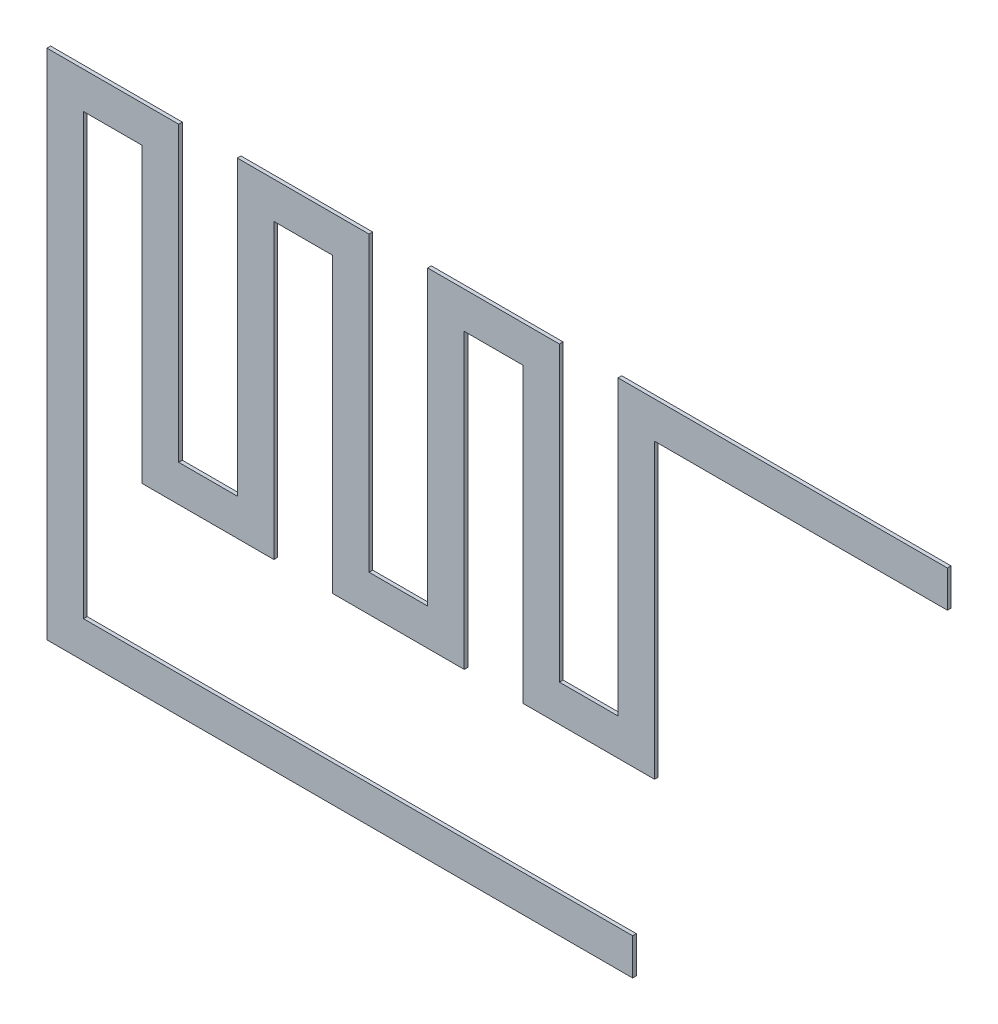
ISO-10303-21;
HEADER;
FILE_DESCRIPTION(('STEP AP214'),'2;1');
FILE_NAME('part.step','',(''),(''),'','','');
FILE_SCHEMA(('AUTOMOTIVE_DESIGN { 1 0 10303 214 1 1 1 1 }'));
ENDSEC;
DATA;
#1=APPLICATION_CONTEXT('core data for automotive mechanical design processes');
#2=APPLICATION_PROTOCOL_DEFINITION('international standard','automotive_design',2000,#1);
#3=PRODUCT_CONTEXT('',#1,'mechanical');
#4=PRODUCT('Part','Part','',(#3));
#5=PRODUCT_RELATED_PRODUCT_CATEGORY('part','',(#4));
#6=PRODUCT_DEFINITION_FORMATION('','',#4);
#7=PRODUCT_DEFINITION_CONTEXT('part definition',#1,'design');
#8=PRODUCT_DEFINITION('design','',#6,#7);
#9=PRODUCT_DEFINITION_SHAPE('','',#8);
#10=(LENGTH_UNIT() NAMED_UNIT(*) SI_UNIT(.MILLI.,.METRE.));
#11=(NAMED_UNIT(*) PLANE_ANGLE_UNIT() SI_UNIT($,.RADIAN.));
#12=(NAMED_UNIT(*) SI_UNIT($,.STERADIAN.) SOLID_ANGLE_UNIT());
#13=UNCERTAINTY_MEASURE_WITH_UNIT(LENGTH_MEASURE(1.E-05),#10,'distance_accuracy_value','');
#14=(GEOMETRIC_REPRESENTATION_CONTEXT(3) GLOBAL_UNCERTAINTY_ASSIGNED_CONTEXT((#13)) GLOBAL_UNIT_ASSIGNED_CONTEXT((#10,
#11,#12)) REPRESENTATION_CONTEXT('',''));
#15=CARTESIAN_POINT('',(0.,0.,0.));
#16=DIRECTION('',(0.,0.,1.));
#17=DIRECTION('',(1.,0.,0.));
#18=AXIS2_PLACEMENT_3D('',#15,#16,#17);
#19=CARTESIAN_POINT('',(4.513681102362,4.058562992126,0.025));
#20=DIRECTION('',(0.,0.,1.));
#21=DIRECTION('',(1.,0.,0.));
#22=AXIS2_PLACEMENT_3D('',#19,#20,#21);
#23=PLANE('',#22);
#24=DIRECTION('',(1.,0.,0.));
#25=VECTOR('',#24,1.);
#26=CARTESIAN_POINT('',(2.6,3.,0.025));
#27=LINE('',#26,#25);
#28=CARTESIAN_POINT('',(1.8,3.,0.025));
#29=VERTEX_POINT('',#28);
#30=CARTESIAN_POINT('',(2.6,3.,0.025));
#31=VERTEX_POINT('',#30);
#32=EDGE_CURVE('E463',#29,#31,#27,.T.);
#33=ORIENTED_EDGE('',*,*,#32,.F.);
#34=DIRECTION('',(0.,-1.,0.));
#35=VECTOR('',#34,1.);
#36=CARTESIAN_POINT('',(1.8,3.,0.025));
#37=LINE('',#36,#35);
#38=CARTESIAN_POINT('',(1.8,7.,0.025));
#39=VERTEX_POINT('',#38);
#40=EDGE_CURVE('E411',#39,#29,#37,.T.);
#41=ORIENTED_EDGE('',*,*,#40,.F.);
#42=DIRECTION('',(1.,0.,0.));
#43=VECTOR('',#42,1.);
#44=CARTESIAN_POINT('',(1.8,7.,0.025));
#45=LINE('',#44,#43);
#46=CARTESIAN_POINT('',(0.,7.,0.025));
#47=VERTEX_POINT('',#46);
#48=EDGE_CURVE('E358',#47,#39,#45,.T.);
#49=ORIENTED_EDGE('',*,*,#48,.F.);
#50=DIRECTION('',(0.,1.,0.));
#51=VECTOR('',#50,1.);
#52=CARTESIAN_POINT('',(0.,7.,0.025));
#53=LINE('',#52,#51);
#54=CARTESIAN_POINT('',(0.,0.,0.025));
#55=VERTEX_POINT('',#54);
#56=EDGE_CURVE('E357',#55,#47,#53,.T.);
#57=ORIENTED_EDGE('',*,*,#56,.F.);
#58=DIRECTION('',(-1.,0.,0.));
#59=VECTOR('',#58,1.);
#60=CARTESIAN_POINT('',(0.,0.,0.025));
#61=LINE('',#60,#59);
#62=CARTESIAN_POINT('',(8.,0.,0.025));
#63=VERTEX_POINT('',#62);
#64=EDGE_CURVE('E487',#63,#55,#61,.T.);
#65=ORIENTED_EDGE('',*,*,#64,.F.);
#66=DIRECTION('',(0.,-1.,0.));
#67=VECTOR('',#66,1.);
#68=CARTESIAN_POINT('',(8.,0.,0.025));
#69=LINE('',#68,#67);
#70=CARTESIAN_POINT('',(8.,0.5,0.025));
#71=VERTEX_POINT('',#70);
#72=EDGE_CURVE('E27',#71,#63,#69,.T.);
#73=ORIENTED_EDGE('',*,*,#72,.F.);
#74=DIRECTION('',(1.,0.,0.));
#75=VECTOR('',#74,1.);
#76=CARTESIAN_POINT('',(8.,0.5,0.025));
#77=LINE('',#76,#75);
#78=CARTESIAN_POINT('',(0.5,0.5,0.025));
#79=VERTEX_POINT('',#78);
#80=EDGE_CURVE('E11',#79,#71,#77,.T.);
#81=ORIENTED_EDGE('',*,*,#80,.F.);
#82=DIRECTION('',(0.,-1.,0.));
#83=VECTOR('',#82,1.);
#84=CARTESIAN_POINT('',(0.5,0.5,0.025));
#85=LINE('',#84,#83);
#86=CARTESIAN_POINT('',(0.5,6.5,0.025));
#87=VERTEX_POINT('',#86);
#88=EDGE_CURVE('E380',#87,#79,#85,.T.);
#89=ORIENTED_EDGE('',*,*,#88,.F.);
#90=DIRECTION('',(-1.,0.,0.));
#91=VECTOR('',#90,1.);
#92=CARTESIAN_POINT('',(0.5,6.5,0.025));
#93=LINE('',#92,#91);
#94=CARTESIAN_POINT('',(1.3,6.5,0.025));
#95=VERTEX_POINT('',#94);
#96=EDGE_CURVE('E275',#95,#87,#93,.T.);
#97=ORIENTED_EDGE('',*,*,#96,.F.);
#98=DIRECTION('',(0.,1.,0.));
#99=VECTOR('',#98,1.);
#100=CARTESIAN_POINT('',(1.3,6.5,0.025));
#101=LINE('',#100,#99);
#102=CARTESIAN_POINT('',(1.3,2.5,0.025));
#103=VERTEX_POINT('',#102);
#104=EDGE_CURVE('E274',#103,#95,#101,.T.);
#105=ORIENTED_EDGE('',*,*,#104,.F.);
#106=DIRECTION('',(-1.,0.,0.));
#107=VECTOR('',#106,1.);
#108=CARTESIAN_POINT('',(1.3,2.5,0.025));
#109=LINE('',#108,#107);
#110=CARTESIAN_POINT('',(3.1,2.5,0.025));
#111=VERTEX_POINT('',#110);
#112=EDGE_CURVE('E270',#111,#103,#109,.T.);
#113=ORIENTED_EDGE('',*,*,#112,.F.);
#114=DIRECTION('',(0.,-1.,0.));
#115=VECTOR('',#114,1.);
#116=CARTESIAN_POINT('',(3.1,2.5,0.025));
#117=LINE('',#116,#115);
#118=CARTESIAN_POINT('',(3.1,6.5,0.025));
#119=VERTEX_POINT('',#118);
#120=EDGE_CURVE('E432',#119,#111,#117,.T.);
#121=ORIENTED_EDGE('',*,*,#120,.F.);
#122=DIRECTION('',(-1.,0.,0.));
#123=VECTOR('',#122,1.);
#124=CARTESIAN_POINT('',(3.1,6.5,0.025));
#125=LINE('',#124,#123);
#126=CARTESIAN_POINT('',(3.9,6.5,0.025));
#127=VERTEX_POINT('',#126);
#128=EDGE_CURVE('E20',#127,#119,#125,.T.);
#129=ORIENTED_EDGE('',*,*,#128,.F.);
#130=DIRECTION('',(0.,1.,0.));
#131=VECTOR('',#130,1.);
#132=CARTESIAN_POINT('',(3.9,6.5,0.025));
#133=LINE('',#132,#131);
#134=CARTESIAN_POINT('',(3.9,2.5,0.025));
#135=VERTEX_POINT('',#134);
#136=EDGE_CURVE('E376',#135,#127,#133,.T.);
#137=ORIENTED_EDGE('',*,*,#136,.F.);
#138=DIRECTION('',(-1.,0.,0.));
#139=VECTOR('',#138,1.);
#140=CARTESIAN_POINT('',(3.9,2.5,0.025));
#141=LINE('',#140,#139);
#142=CARTESIAN_POINT('',(5.7,2.5,0.025));
#143=VERTEX_POINT('',#142);
#144=EDGE_CURVE('E495',#143,#135,#141,.T.);
#145=ORIENTED_EDGE('',*,*,#144,.F.);
#146=DIRECTION('',(0.,-1.,0.));
#147=VECTOR('',#146,1.);
#148=CARTESIAN_POINT('',(5.7,2.5,0.025));
#149=LINE('',#148,#147);
#150=CARTESIAN_POINT('',(5.7,6.5,0.025));
#151=VERTEX_POINT('',#150);
#152=EDGE_CURVE('E359',#151,#143,#149,.T.);
#153=ORIENTED_EDGE('',*,*,#152,.F.);
#154=DIRECTION('',(-1.,0.,0.));
#155=VECTOR('',#154,1.);
#156=CARTESIAN_POINT('',(5.7,6.5,0.025));
#157=LINE('',#156,#155);
#158=CARTESIAN_POINT('',(6.5,6.5,0.025));
#159=VERTEX_POINT('',#158);
#160=EDGE_CURVE('E458',#159,#151,#157,.T.);
#161=ORIENTED_EDGE('',*,*,#160,.F.);
#162=DIRECTION('',(0.,1.,0.));
#163=VECTOR('',#162,1.);
#164=CARTESIAN_POINT('',(6.5,6.5,0.025));
#165=LINE('',#164,#163);
#166=CARTESIAN_POINT('',(6.5,2.5,0.025));
#167=VERTEX_POINT('',#166);
#168=EDGE_CURVE('E312',#167,#159,#165,.T.);
#169=ORIENTED_EDGE('',*,*,#168,.F.);
#170=DIRECTION('',(-1.,0.,0.));
#171=VECTOR('',#170,1.);
#172=CARTESIAN_POINT('',(6.5,2.5,0.025));
#173=LINE('',#172,#171);
#174=CARTESIAN_POINT('',(8.3,2.5,0.025));
#175=VERTEX_POINT('',#174);
#176=EDGE_CURVE('E335',#175,#167,#173,.T.);
#177=ORIENTED_EDGE('',*,*,#176,.F.);
#178=DIRECTION('',(0.,-1.,0.));
#179=VECTOR('',#178,1.);
#180=CARTESIAN_POINT('',(8.3,2.5,0.025));
#181=LINE('',#180,#179);
#182=CARTESIAN_POINT('',(8.3,6.5,0.025));
#183=VERTEX_POINT('',#182);
#184=EDGE_CURVE('E334',#183,#175,#181,.T.);
#185=ORIENTED_EDGE('',*,*,#184,.F.);
#186=DIRECTION('',(-1.,0.,0.));
#187=VECTOR('',#186,1.);
#188=CARTESIAN_POINT('',(8.3,6.5,0.025));
#189=LINE('',#188,#187);
#190=CARTESIAN_POINT('',(12.3,6.5,0.025));
#191=VERTEX_POINT('',#190);
#192=EDGE_CURVE('E398',#191,#183,#189,.T.);
#193=ORIENTED_EDGE('',*,*,#192,.F.);
#194=DIRECTION('',(0.,-1.,0.));
#195=VECTOR('',#194,1.);
#196=CARTESIAN_POINT('',(12.3,6.5,0.025));
#197=LINE('',#196,#195);
#198=CARTESIAN_POINT('',(12.3,7.,0.025));
#199=VERTEX_POINT('',#198);
#200=EDGE_CURVE('E436',#199,#191,#197,.T.);
#201=ORIENTED_EDGE('',*,*,#200,.F.);
#202=DIRECTION('',(1.,0.,0.));
#203=VECTOR('',#202,1.);
#204=CARTESIAN_POINT('',(12.3,7.,0.025));
#205=LINE('',#204,#203);
#206=CARTESIAN_POINT('',(7.8,7.,0.025));
#207=VERTEX_POINT('',#206);
#208=EDGE_CURVE('E329',#207,#199,#205,.T.);
#209=ORIENTED_EDGE('',*,*,#208,.F.);
#210=DIRECTION('',(0.,1.,0.));
#211=VECTOR('',#210,1.);
#212=CARTESIAN_POINT('',(7.8,7.,0.025));
#213=LINE('',#212,#211);
#214=CARTESIAN_POINT('',(7.8,3.,0.025));
#215=VERTEX_POINT('',#214);
#216=EDGE_CURVE('E328',#215,#207,#213,.T.);
#217=ORIENTED_EDGE('',*,*,#216,.F.);
#218=DIRECTION('',(1.,0.,0.));
#219=VECTOR('',#218,1.);
#220=CARTESIAN_POINT('',(7.8,3.,0.025));
#221=LINE('',#220,#219);
#222=CARTESIAN_POINT('',(7.,3.,0.025));
#223=VERTEX_POINT('',#222);
#224=EDGE_CURVE('E336',#223,#215,#221,.T.);
#225=ORIENTED_EDGE('',*,*,#224,.F.);
#226=DIRECTION('',(0.,-1.,0.));
#227=VECTOR('',#226,1.);
#228=CARTESIAN_POINT('',(7.,3.,0.025));
#229=LINE('',#228,#227);
#230=CARTESIAN_POINT('',(7.,7.,0.025));
#231=VERTEX_POINT('',#230);
#232=EDGE_CURVE('E346',#231,#223,#229,.T.);
#233=ORIENTED_EDGE('',*,*,#232,.F.);
#234=DIRECTION('',(1.,0.,0.));
#235=VECTOR('',#234,1.);
#236=CARTESIAN_POINT('',(7.,7.,0.025));
#237=LINE('',#236,#235);
#238=CARTESIAN_POINT('',(5.2,7.,0.025));
#239=VERTEX_POINT('',#238);
#240=EDGE_CURVE('E345',#239,#231,#237,.T.);
#241=ORIENTED_EDGE('',*,*,#240,.F.);
#242=DIRECTION('',(0.,1.,0.));
#243=VECTOR('',#242,1.);
#244=CARTESIAN_POINT('',(5.2,7.,0.025));
#245=LINE('',#244,#243);
#246=CARTESIAN_POINT('',(5.2,3.,0.025));
#247=VERTEX_POINT('',#246);
#248=EDGE_CURVE('E352',#247,#239,#245,.T.);
#249=ORIENTED_EDGE('',*,*,#248,.F.);
#250=DIRECTION('',(1.,0.,0.));
#251=VECTOR('',#250,1.);
#252=CARTESIAN_POINT('',(5.2,3.,0.025));
#253=LINE('',#252,#251);
#254=CARTESIAN_POINT('',(4.4,3.,0.025));
#255=VERTEX_POINT('',#254);
#256=EDGE_CURVE('E351',#255,#247,#253,.T.);
#257=ORIENTED_EDGE('',*,*,#256,.F.);
#258=DIRECTION('',(0.,-1.,0.));
#259=VECTOR('',#258,1.);
#260=CARTESIAN_POINT('',(4.4,3.,0.025));
#261=LINE('',#260,#259);
#262=CARTESIAN_POINT('',(4.4,7.,0.025));
#263=VERTEX_POINT('',#262);
#264=EDGE_CURVE('E387',#263,#255,#261,.T.);
#265=ORIENTED_EDGE('',*,*,#264,.F.);
#266=DIRECTION('',(1.,0.,0.));
#267=VECTOR('',#266,1.);
#268=CARTESIAN_POINT('',(4.4,7.,0.025));
#269=LINE('',#268,#267);
#270=CARTESIAN_POINT('',(2.6,7.,0.025));
#271=VERTEX_POINT('',#270);
#272=EDGE_CURVE('E403',#271,#263,#269,.T.);
#273=ORIENTED_EDGE('',*,*,#272,.F.);
#274=DIRECTION('',(0.,1.,0.));
#275=VECTOR('',#274,1.);
#276=CARTESIAN_POINT('',(2.6,7.,0.025));
#277=LINE('',#276,#275);
#278=EDGE_CURVE('E464',#31,#271,#277,.T.);
#279=ORIENTED_EDGE('',*,*,#278,.F.);
#280=EDGE_LOOP('',(#33,#41,#49,#57,#65,#73,#81,#89,#97,#105,#113,#121,#129,#137,#145,#153,#161,
#169,#177,#185,#193,#201,#209,#217,#225,#233,#241,#249,#257,#265,#273,#279));
#281=FACE_BOUND('',#280,.T.);
#282=ADVANCED_FACE('F16',(#281),#23,.T.);
#283=CARTESIAN_POINT('',(8.,0.5,0.));
#284=DIRECTION('',(0.,1.,0.));
#285=DIRECTION('',(1.,0.,0.));
#286=AXIS2_PLACEMENT_3D('',#283,#284,#285);
#287=PLANE('',#286);
#288=DIRECTION('',(0.,0.,-1.));
#289=VECTOR('',#288,1.);
#290=CARTESIAN_POINT('',(0.5,0.5,0.));
#291=LINE('',#290,#289);
#292=CARTESIAN_POINT('',(0.5,0.5,-0.025));
#293=VERTEX_POINT('',#292);
#294=EDGE_CURVE('E377',#79,#293,#291,.T.);
#295=ORIENTED_EDGE('',*,*,#294,.F.);
#296=ORIENTED_EDGE('',*,*,#80,.T.);
#297=DIRECTION('',(0.,0.,1.));
#298=VECTOR('',#297,1.);
#299=CARTESIAN_POINT('',(8.,0.5,0.));
#300=LINE('',#299,#298);
#301=CARTESIAN_POINT('',(8.,0.5,-0.025));
#302=VERTEX_POINT('',#301);
#303=EDGE_CURVE('E490',#302,#71,#300,.T.);
#304=ORIENTED_EDGE('',*,*,#303,.F.);
#305=DIRECTION('',(1.,0.,0.));
#306=VECTOR('',#305,1.);
#307=CARTESIAN_POINT('',(4.513681102362,0.5,-0.025));
#308=LINE('',#307,#306);
#309=EDGE_CURVE('E418',#293,#302,#308,.T.);
#310=ORIENTED_EDGE('',*,*,#309,.F.);
#311=EDGE_LOOP('',(#295,#296,#304,#310));
#312=FACE_BOUND('',#311,.T.);
#313=ADVANCED_FACE('F688',(#312),#287,.T.);
#314=CARTESIAN_POINT('',(8.,0.,0.));
#315=DIRECTION('',(1.,0.,0.));
#316=DIRECTION('',(0.,-1.,0.));
#317=AXIS2_PLACEMENT_3D('',#314,#315,#316);
#318=PLANE('',#317);
#319=ORIENTED_EDGE('',*,*,#303,.T.);
#320=ORIENTED_EDGE('',*,*,#72,.T.);
#321=DIRECTION('',(0.,0.,1.));
#322=VECTOR('',#321,1.);
#323=CARTESIAN_POINT('',(8.,0.,0.));
#324=LINE('',#323,#322);
#325=CARTESIAN_POINT('',(8.,0.,-0.025));
#326=VERTEX_POINT('',#325);
#327=EDGE_CURVE('E477',#326,#63,#324,.T.);
#328=ORIENTED_EDGE('',*,*,#327,.F.);
#329=DIRECTION('',(0.,-1.,0.));
#330=VECTOR('',#329,1.);
#331=CARTESIAN_POINT('',(8.,4.058562992126,-0.025));
#332=LINE('',#331,#330);
#333=EDGE_CURVE('E422',#302,#326,#332,.T.);
#334=ORIENTED_EDGE('',*,*,#333,.F.);
#335=EDGE_LOOP('',(#319,#320,#328,#334));
#336=FACE_BOUND('',#335,.T.);
#337=ADVANCED_FACE('F690',(#336),#318,.T.);
#338=CARTESIAN_POINT('',(0.,0.,0.));
#339=DIRECTION('',(0.,-1.,0.));
#340=DIRECTION('',(0.,0.,-1.));
#341=AXIS2_PLACEMENT_3D('',#338,#339,#340);
#342=PLANE('',#341);
#343=ORIENTED_EDGE('',*,*,#327,.T.);
#344=ORIENTED_EDGE('',*,*,#64,.T.);
#345=DIRECTION('',(0.,0.,1.));
#346=VECTOR('',#345,1.);
#347=CARTESIAN_POINT('',(0.,0.,0.));
#348=LINE('',#347,#346);
#349=CARTESIAN_POINT('',(0.,0.,-0.025));
#350=VERTEX_POINT('',#349);
#351=EDGE_CURVE('E353',#350,#55,#348,.T.);
#352=ORIENTED_EDGE('',*,*,#351,.F.);
#353=DIRECTION('',(-1.,0.,0.));
#354=VECTOR('',#353,1.);
#355=CARTESIAN_POINT('',(4.513681102362,0.,-0.025));
#356=LINE('',#355,#354);
#357=EDGE_CURVE('E474',#326,#350,#356,.T.);
#358=ORIENTED_EDGE('',*,*,#357,.F.);
#359=EDGE_LOOP('',(#343,#344,#352,#358));
#360=FACE_BOUND('',#359,.T.);
#361=ADVANCED_FACE('F694',(#360),#342,.T.);
#362=CARTESIAN_POINT('',(0.,7.,0.));
#363=DIRECTION('',(-1.,0.,0.));
#364=DIRECTION('',(0.,0.,1.));
#365=AXIS2_PLACEMENT_3D('',#362,#363,#364);
#366=PLANE('',#365);
#367=ORIENTED_EDGE('',*,*,#351,.T.);
#368=ORIENTED_EDGE('',*,*,#56,.T.);
#369=DIRECTION('',(0.,0.,1.));
#370=VECTOR('',#369,1.);
#371=CARTESIAN_POINT('',(0.,7.,0.));
#372=LINE('',#371,#370);
#373=CARTESIAN_POINT('',(0.,7.,-0.025));
#374=VERTEX_POINT('',#373);
#375=EDGE_CURVE('E407',#374,#47,#372,.T.);
#376=ORIENTED_EDGE('',*,*,#375,.F.);
#377=DIRECTION('',(0.,1.,0.));
#378=VECTOR('',#377,1.);
#379=CARTESIAN_POINT('',(0.,4.058562992126,-0.025));
#380=LINE('',#379,#378);
#381=EDGE_CURVE('E323',#350,#374,#380,.T.);
#382=ORIENTED_EDGE('',*,*,#381,.F.);
#383=EDGE_LOOP('',(#367,#368,#376,#382));
#384=FACE_BOUND('',#383,.T.);
#385=ADVANCED_FACE('F698',(#384),#366,.T.);
#386=CARTESIAN_POINT('',(1.8,7.,0.));
#387=DIRECTION('',(0.,1.,0.));
#388=DIRECTION('',(1.,0.,0.));
#389=AXIS2_PLACEMENT_3D('',#386,#387,#388);
#390=PLANE('',#389);
#391=ORIENTED_EDGE('',*,*,#375,.T.);
#392=ORIENTED_EDGE('',*,*,#48,.T.);
#393=DIRECTION('',(0.,0.,1.));
#394=VECTOR('',#393,1.);
#395=CARTESIAN_POINT('',(1.8,7.,0.));
#396=LINE('',#395,#394);
#397=CARTESIAN_POINT('',(1.8,7.,-0.025));
#398=VERTEX_POINT('',#397);
#399=EDGE_CURVE('E483',#398,#39,#396,.T.);
#400=ORIENTED_EDGE('',*,*,#399,.F.);
#401=DIRECTION('',(1.,0.,0.));
#402=VECTOR('',#401,1.);
#403=CARTESIAN_POINT('',(4.513681102362,7.,-0.025));
#404=LINE('',#403,#402);
#405=EDGE_CURVE('E318',#374,#398,#404,.T.);
#406=ORIENTED_EDGE('',*,*,#405,.F.);
#407=EDGE_LOOP('',(#391,#392,#400,#406));
#408=FACE_BOUND('',#407,.T.);
#409=ADVANCED_FACE('F702',(#408),#390,.T.);
#410=CARTESIAN_POINT('',(1.8,3.,0.));
#411=DIRECTION('',(1.,0.,0.));
#412=DIRECTION('',(0.,-1.,0.));
#413=AXIS2_PLACEMENT_3D('',#410,#411,#412);
#414=PLANE('',#413);
#415=ORIENTED_EDGE('',*,*,#399,.T.);
#416=ORIENTED_EDGE('',*,*,#40,.T.);
#417=DIRECTION('',(0.,0.,1.));
#418=VECTOR('',#417,1.);
#419=CARTESIAN_POINT('',(1.8,3.,0.));
#420=LINE('',#419,#418);
#421=CARTESIAN_POINT('',(1.8,3.,-0.025));
#422=VERTEX_POINT('',#421);
#423=EDGE_CURVE('E459',#422,#29,#420,.T.);
#424=ORIENTED_EDGE('',*,*,#423,.F.);
#425=DIRECTION('',(0.,-1.,0.));
#426=VECTOR('',#425,1.);
#427=CARTESIAN_POINT('',(1.8,4.058562992126,-0.025));
#428=LINE('',#427,#426);
#429=EDGE_CURVE('E322',#398,#422,#428,.T.);
#430=ORIENTED_EDGE('',*,*,#429,.F.);
#431=EDGE_LOOP('',(#415,#416,#424,#430));
#432=FACE_BOUND('',#431,.T.);
#433=ADVANCED_FACE('F663',(#432),#414,.T.);
#434=CARTESIAN_POINT('',(2.6,3.,0.));
#435=DIRECTION('',(0.,1.,0.));
#436=DIRECTION('',(1.,0.,0.));
#437=AXIS2_PLACEMENT_3D('',#434,#435,#436);
#438=PLANE('',#437);
#439=ORIENTED_EDGE('',*,*,#423,.T.);
#440=ORIENTED_EDGE('',*,*,#32,.T.);
#441=DIRECTION('',(0.,0.,1.));
#442=VECTOR('',#441,1.);
#443=CARTESIAN_POINT('',(2.6,3.,0.));
#444=LINE('',#443,#442);
#445=CARTESIAN_POINT('',(2.6,3.,-0.025));
#446=VERTEX_POINT('',#445);
#447=EDGE_CURVE('E406',#446,#31,#444,.T.);
#448=ORIENTED_EDGE('',*,*,#447,.F.);
#449=DIRECTION('',(1.,0.,0.));
#450=VECTOR('',#449,1.);
#451=CARTESIAN_POINT('',(4.513681102362,3.,-0.025));
#452=LINE('',#451,#450);
#453=EDGE_CURVE('E367',#422,#446,#452,.T.);
#454=ORIENTED_EDGE('',*,*,#453,.F.);
#455=EDGE_LOOP('',(#439,#440,#448,#454));
#456=FACE_BOUND('',#455,.T.);
#457=ADVANCED_FACE('F18',(#456),#438,.T.);
#458=CARTESIAN_POINT('',(2.6,7.,0.));
#459=DIRECTION('',(-1.,0.,0.));
#460=DIRECTION('',(0.,0.,1.));
#461=AXIS2_PLACEMENT_3D('',#458,#459,#460);
#462=PLANE('',#461);
#463=ORIENTED_EDGE('',*,*,#447,.T.);
#464=ORIENTED_EDGE('',*,*,#278,.T.);
#465=DIRECTION('',(0.,0.,1.));
#466=VECTOR('',#465,1.);
#467=CARTESIAN_POINT('',(2.6,7.,0.));
#468=LINE('',#467,#466);
#469=CARTESIAN_POINT('',(2.6,7.,-0.025));
#470=VERTEX_POINT('',#469);
#471=EDGE_CURVE('E390',#470,#271,#468,.T.);
#472=ORIENTED_EDGE('',*,*,#471,.F.);
#473=DIRECTION('',(0.,1.,0.));
#474=VECTOR('',#473,1.);
#475=CARTESIAN_POINT('',(2.6,4.058562992126,-0.025));
#476=LINE('',#475,#474);
#477=EDGE_CURVE('E371',#446,#470,#476,.T.);
#478=ORIENTED_EDGE('',*,*,#477,.F.);
#479=EDGE_LOOP('',(#463,#464,#472,#478));
#480=FACE_BOUND('',#479,.T.);
#481=ADVANCED_FACE('F657',(#480),#462,.T.);
#482=CARTESIAN_POINT('',(4.4,7.,0.));
#483=DIRECTION('',(0.,1.,0.));
#484=DIRECTION('',(1.,0.,0.));
#485=AXIS2_PLACEMENT_3D('',#482,#483,#484);
#486=PLANE('',#485);
#487=ORIENTED_EDGE('',*,*,#471,.T.);
#488=ORIENTED_EDGE('',*,*,#272,.T.);
#489=DIRECTION('',(0.,0.,1.));
#490=VECTOR('',#489,1.);
#491=CARTESIAN_POINT('',(4.4,7.,0.));
#492=LINE('',#491,#490);
#493=CARTESIAN_POINT('',(4.4,7.,-0.025));
#494=VERTEX_POINT('',#493);
#495=EDGE_CURVE('E391',#494,#263,#492,.T.);
#496=ORIENTED_EDGE('',*,*,#495,.F.);
#497=DIRECTION('',(1.,0.,0.));
#498=VECTOR('',#497,1.);
#499=CARTESIAN_POINT('',(4.513681102362,7.,-0.025));
#500=LINE('',#499,#498);
#501=EDGE_CURVE('E307',#470,#494,#500,.T.);
#502=ORIENTED_EDGE('',*,*,#501,.F.);
#503=EDGE_LOOP('',(#487,#488,#496,#502));
#504=FACE_BOUND('',#503,.T.);
#505=ADVANCED_FACE('F652',(#504),#486,.T.);
#506=CARTESIAN_POINT('',(4.4,3.,0.));
#507=DIRECTION('',(1.,0.,0.));
#508=DIRECTION('',(0.,-1.,0.));
#509=AXIS2_PLACEMENT_3D('',#506,#507,#508);
#510=PLANE('',#509);
#511=ORIENTED_EDGE('',*,*,#495,.T.);
#512=ORIENTED_EDGE('',*,*,#264,.T.);
#513=DIRECTION('',(0.,0.,1.));
#514=VECTOR('',#513,1.);
#515=CARTESIAN_POINT('',(4.4,3.,0.));
#516=LINE('',#515,#514);
#517=CARTESIAN_POINT('',(4.4,3.,-0.025));
#518=VERTEX_POINT('',#517);
#519=EDGE_CURVE('E347',#518,#255,#516,.T.);
#520=ORIENTED_EDGE('',*,*,#519,.F.);
#521=DIRECTION('',(0.,-1.,0.));
#522=VECTOR('',#521,1.);
#523=CARTESIAN_POINT('',(4.4,4.058562992126,-0.025));
#524=LINE('',#523,#522);
#525=EDGE_CURVE('E303',#494,#518,#524,.T.);
#526=ORIENTED_EDGE('',*,*,#525,.F.);
#527=EDGE_LOOP('',(#511,#512,#520,#526));
#528=FACE_BOUND('',#527,.T.);
#529=ADVANCED_FACE('F649',(#528),#510,.T.);
#530=CARTESIAN_POINT('',(5.2,3.,0.));
#531=DIRECTION('',(0.,1.,0.));
#532=DIRECTION('',(1.,0.,0.));
#533=AXIS2_PLACEMENT_3D('',#530,#531,#532);
#534=PLANE('',#533);
#535=ORIENTED_EDGE('',*,*,#519,.T.);
#536=ORIENTED_EDGE('',*,*,#256,.T.);
#537=DIRECTION('',(0.,0.,1.));
#538=VECTOR('',#537,1.);
#539=CARTESIAN_POINT('',(5.2,3.,0.));
#540=LINE('',#539,#538);
#541=CARTESIAN_POINT('',(5.2,3.,-0.025));
#542=VERTEX_POINT('',#541);
#543=EDGE_CURVE('E445',#542,#247,#540,.T.);
#544=ORIENTED_EDGE('',*,*,#543,.F.);
#545=DIRECTION('',(1.,0.,0.));
#546=VECTOR('',#545,1.);
#547=CARTESIAN_POINT('',(4.513681102362,3.,-0.025));
#548=LINE('',#547,#546);
#549=EDGE_CURVE('E306',#518,#542,#548,.T.);
#550=ORIENTED_EDGE('',*,*,#549,.F.);
#551=EDGE_LOOP('',(#535,#536,#544,#550));
#552=FACE_BOUND('',#551,.T.);
#553=ADVANCED_FACE('F646',(#552),#534,.T.);
#554=CARTESIAN_POINT('',(5.2,7.,0.));
#555=DIRECTION('',(-1.,0.,0.));
#556=DIRECTION('',(0.,0.,1.));
#557=AXIS2_PLACEMENT_3D('',#554,#555,#556);
#558=PLANE('',#557);
#559=ORIENTED_EDGE('',*,*,#543,.T.);
#560=ORIENTED_EDGE('',*,*,#248,.T.);
#561=DIRECTION('',(0.,0.,1.));
#562=VECTOR('',#561,1.);
#563=CARTESIAN_POINT('',(5.2,7.,0.));
#564=LINE('',#563,#562);
#565=CARTESIAN_POINT('',(5.2,7.,-0.025));
#566=VERTEX_POINT('',#565);
#567=EDGE_CURVE('E341',#566,#239,#564,.T.);
#568=ORIENTED_EDGE('',*,*,#567,.F.);
#569=DIRECTION('',(0.,1.,0.));
#570=VECTOR('',#569,1.);
#571=CARTESIAN_POINT('',(5.2,4.058562992126,-0.025));
#572=LINE('',#571,#570);
#573=EDGE_CURVE('E502',#542,#566,#572,.T.);
#574=ORIENTED_EDGE('',*,*,#573,.F.);
#575=EDGE_LOOP('',(#559,#560,#568,#574));
#576=FACE_BOUND('',#575,.T.);
#577=ADVANCED_FACE('F641',(#576),#558,.T.);
#578=CARTESIAN_POINT('',(7.,7.,0.));
#579=DIRECTION('',(0.,1.,0.));
#580=DIRECTION('',(1.,0.,0.));
#581=AXIS2_PLACEMENT_3D('',#578,#579,#580);
#582=PLANE('',#581);
#583=ORIENTED_EDGE('',*,*,#567,.T.);
#584=ORIENTED_EDGE('',*,*,#240,.T.);
#585=DIRECTION('',(0.,0.,1.));
#586=VECTOR('',#585,1.);
#587=CARTESIAN_POINT('',(7.,7.,0.));
#588=LINE('',#587,#586);
#589=CARTESIAN_POINT('',(7.,7.,-0.025));
#590=VERTEX_POINT('',#589);
#591=EDGE_CURVE('E339',#590,#231,#588,.T.);
#592=ORIENTED_EDGE('',*,*,#591,.F.);
#593=DIRECTION('',(1.,0.,0.));
#594=VECTOR('',#593,1.);
#595=CARTESIAN_POINT('',(4.513681102362,7.,-0.025));
#596=LINE('',#595,#594);
#597=EDGE_CURVE('E508',#566,#590,#596,.T.);
#598=ORIENTED_EDGE('',*,*,#597,.F.);
#599=EDGE_LOOP('',(#583,#584,#592,#598));
#600=FACE_BOUND('',#599,.T.);
#601=ADVANCED_FACE('F625',(#600),#582,.T.);
#602=CARTESIAN_POINT('',(7.,3.,0.));
#603=DIRECTION('',(1.,0.,0.));
#604=DIRECTION('',(0.,-1.,0.));
#605=AXIS2_PLACEMENT_3D('',#602,#603,#604);
#606=PLANE('',#605);
#607=ORIENTED_EDGE('',*,*,#591,.T.);
#608=ORIENTED_EDGE('',*,*,#232,.T.);
#609=DIRECTION('',(0.,0.,1.));
#610=VECTOR('',#609,1.);
#611=CARTESIAN_POINT('',(7.,3.,0.));
#612=LINE('',#611,#610);
#613=CARTESIAN_POINT('',(7.,3.,-0.025));
#614=VERTEX_POINT('',#613);
#615=EDGE_CURVE('E340',#614,#223,#612,.T.);
#616=ORIENTED_EDGE('',*,*,#615,.F.);
#617=DIRECTION('',(0.,-1.,0.));
#618=VECTOR('',#617,1.);
#619=CARTESIAN_POINT('',(7.,4.058562992126,-0.025));
#620=LINE('',#619,#618);
#621=EDGE_CURVE('E503',#590,#614,#620,.T.);
#622=ORIENTED_EDGE('',*,*,#621,.F.);
#623=EDGE_LOOP('',(#607,#608,#616,#622));
#624=FACE_BOUND('',#623,.T.);
#625=ADVANCED_FACE('F636',(#624),#606,.T.);
#626=CARTESIAN_POINT('',(7.8,3.,0.));
#627=DIRECTION('',(0.,1.,0.));
#628=DIRECTION('',(1.,0.,0.));
#629=AXIS2_PLACEMENT_3D('',#626,#627,#628);
#630=PLANE('',#629);
#631=ORIENTED_EDGE('',*,*,#615,.T.);
#632=ORIENTED_EDGE('',*,*,#224,.T.);
#633=DIRECTION('',(0.,0.,1.));
#634=VECTOR('',#633,1.);
#635=CARTESIAN_POINT('',(7.8,3.,0.));
#636=LINE('',#635,#634);
#637=CARTESIAN_POINT('',(7.8,3.,-0.025));
#638=VERTEX_POINT('',#637);
#639=EDGE_CURVE('E324',#638,#215,#636,.T.);
#640=ORIENTED_EDGE('',*,*,#639,.F.);
#641=DIRECTION('',(1.,0.,0.));
#642=VECTOR('',#641,1.);
#643=CARTESIAN_POINT('',(4.513681102362,3.,-0.025));
#644=LINE('',#643,#642);
#645=EDGE_CURVE('E507',#614,#638,#644,.T.);
#646=ORIENTED_EDGE('',*,*,#645,.F.);
#647=EDGE_LOOP('',(#631,#632,#640,#646));
#648=FACE_BOUND('',#647,.T.);
#649=ADVANCED_FACE('F726',(#648),#630,.T.);
#650=CARTESIAN_POINT('',(7.8,7.,0.));
#651=DIRECTION('',(-1.,0.,0.));
#652=DIRECTION('',(0.,1.,0.));
#653=AXIS2_PLACEMENT_3D('',#650,#651,#652);
#654=PLANE('',#653);
#655=ORIENTED_EDGE('',*,*,#639,.T.);
#656=ORIENTED_EDGE('',*,*,#216,.T.);
#657=DIRECTION('',(0.,0.,1.));
#658=VECTOR('',#657,1.);
#659=CARTESIAN_POINT('',(7.8,7.,0.));
#660=LINE('',#659,#658);
#661=CARTESIAN_POINT('',(7.8,7.,-0.025));
#662=VERTEX_POINT('',#661);
#663=EDGE_CURVE('E386',#662,#207,#660,.T.);
#664=ORIENTED_EDGE('',*,*,#663,.F.);
#665=DIRECTION('',(0.,1.,0.));
#666=VECTOR('',#665,1.);
#667=CARTESIAN_POINT('',(7.8,4.058562992126,-0.025));
#668=LINE('',#667,#666);
#669=EDGE_CURVE('E546',#638,#662,#668,.T.);
#670=ORIENTED_EDGE('',*,*,#669,.F.);
#671=EDGE_LOOP('',(#655,#656,#664,#670));
#672=FACE_BOUND('',#671,.T.);
#673=ADVANCED_FACE('F724',(#672),#654,.T.);
#674=CARTESIAN_POINT('',(12.3,7.,0.));
#675=DIRECTION('',(0.,1.,0.));
#676=DIRECTION('',(1.,0.,0.));
#677=AXIS2_PLACEMENT_3D('',#674,#675,#676);
#678=PLANE('',#677);
#679=ORIENTED_EDGE('',*,*,#663,.T.);
#680=ORIENTED_EDGE('',*,*,#208,.T.);
#681=DIRECTION('',(0.,0.,1.));
#682=VECTOR('',#681,1.);
#683=CARTESIAN_POINT('',(12.3,7.,0.));
#684=LINE('',#683,#682);
#685=CARTESIAN_POINT('',(12.3,7.,-0.025));
#686=VERTEX_POINT('',#685);
#687=EDGE_CURVE('E401',#686,#199,#684,.T.);
#688=ORIENTED_EDGE('',*,*,#687,.F.);
#689=DIRECTION('',(1.,0.,0.));
#690=VECTOR('',#689,1.);
#691=CARTESIAN_POINT('',(4.513681102362,7.,-0.025));
#692=LINE('',#691,#690);
#693=EDGE_CURVE('E550',#662,#686,#692,.T.);
#694=ORIENTED_EDGE('',*,*,#693,.F.);
#695=EDGE_LOOP('',(#679,#680,#688,#694));
#696=FACE_BOUND('',#695,.T.);
#697=ADVANCED_FACE('F714',(#696),#678,.T.);
#698=CARTESIAN_POINT('',(12.3,6.5,0.));
#699=DIRECTION('',(1.,0.,0.));
#700=DIRECTION('',(0.,1.,0.));
#701=AXIS2_PLACEMENT_3D('',#698,#699,#700);
#702=PLANE('',#701);
#703=ORIENTED_EDGE('',*,*,#687,.T.);
#704=ORIENTED_EDGE('',*,*,#200,.T.);
#705=DIRECTION('',(0.,0.,1.));
#706=VECTOR('',#705,1.);
#707=CARTESIAN_POINT('',(12.3,6.5,0.));
#708=LINE('',#707,#706);
#709=CARTESIAN_POINT('',(12.3,6.5,-0.025));
#710=VERTEX_POINT('',#709);
#711=EDGE_CURVE('E402',#710,#191,#708,.T.);
#712=ORIENTED_EDGE('',*,*,#711,.F.);
#713=DIRECTION('',(0.,-1.,0.));
#714=VECTOR('',#713,1.);
#715=CARTESIAN_POINT('',(12.3,4.058562992126,-0.025));
#716=LINE('',#715,#714);
#717=EDGE_CURVE('E554',#686,#710,#716,.T.);
#718=ORIENTED_EDGE('',*,*,#717,.F.);
#719=EDGE_LOOP('',(#703,#704,#712,#718));
#720=FACE_BOUND('',#719,.T.);
#721=ADVANCED_FACE('F720',(#720),#702,.T.);
#722=CARTESIAN_POINT('',(8.3,6.5,0.));
#723=DIRECTION('',(0.,-1.,0.));
#724=DIRECTION('',(-1.,0.,0.));
#725=AXIS2_PLACEMENT_3D('',#722,#723,#724);
#726=PLANE('',#725);
#727=ORIENTED_EDGE('',*,*,#711,.T.);
#728=ORIENTED_EDGE('',*,*,#192,.T.);
#729=DIRECTION('',(0.,0.,1.));
#730=VECTOR('',#729,1.);
#731=CARTESIAN_POINT('',(8.3,6.5,0.));
#732=LINE('',#731,#730);
#733=CARTESIAN_POINT('',(8.3,6.5,-0.025));
#734=VERTEX_POINT('',#733);
#735=EDGE_CURVE('E330',#734,#183,#732,.T.);
#736=ORIENTED_EDGE('',*,*,#735,.F.);
#737=DIRECTION('',(-1.,0.,0.));
#738=VECTOR('',#737,1.);
#739=CARTESIAN_POINT('',(4.513681102362,6.5,-0.025));
#740=LINE('',#739,#738);
#741=EDGE_CURVE('E605',#710,#734,#740,.T.);
#742=ORIENTED_EDGE('',*,*,#741,.F.);
#743=EDGE_LOOP('',(#727,#728,#736,#742));
#744=FACE_BOUND('',#743,.T.);
#745=ADVANCED_FACE('F742',(#744),#726,.T.);
#746=CARTESIAN_POINT('',(8.3,2.5,0.));
#747=DIRECTION('',(1.,0.,0.));
#748=DIRECTION('',(0.,1.,0.));
#749=AXIS2_PLACEMENT_3D('',#746,#747,#748);
#750=PLANE('',#749);
#751=ORIENTED_EDGE('',*,*,#735,.T.);
#752=ORIENTED_EDGE('',*,*,#184,.T.);
#753=DIRECTION('',(0.,0.,1.));
#754=VECTOR('',#753,1.);
#755=CARTESIAN_POINT('',(8.3,2.5,0.));
#756=LINE('',#755,#754);
#757=CARTESIAN_POINT('',(8.3,2.5,-0.025));
#758=VERTEX_POINT('',#757);
#759=EDGE_CURVE('E315',#758,#175,#756,.T.);
#760=ORIENTED_EDGE('',*,*,#759,.F.);
#761=DIRECTION('',(0.,-1.,0.));
#762=VECTOR('',#761,1.);
#763=CARTESIAN_POINT('',(8.3,4.058562992126,-0.025));
#764=LINE('',#763,#762);
#765=EDGE_CURVE('E302',#734,#758,#764,.T.);
#766=ORIENTED_EDGE('',*,*,#765,.F.);
#767=EDGE_LOOP('',(#751,#752,#760,#766));
#768=FACE_BOUND('',#767,.T.);
#769=ADVANCED_FACE('F751',(#768),#750,.T.);
#770=CARTESIAN_POINT('',(6.5,2.5,0.));
#771=DIRECTION('',(0.,-1.,0.));
#772=DIRECTION('',(-1.,0.,0.));
#773=AXIS2_PLACEMENT_3D('',#770,#771,#772);
#774=PLANE('',#773);
#775=ORIENTED_EDGE('',*,*,#759,.T.);
#776=ORIENTED_EDGE('',*,*,#176,.T.);
#777=DIRECTION('',(0.,0.,1.));
#778=VECTOR('',#777,1.);
#779=CARTESIAN_POINT('',(6.5,2.5,0.));
#780=LINE('',#779,#778);
#781=CARTESIAN_POINT('',(6.5,2.5,-0.025));
#782=VERTEX_POINT('',#781);
#783=EDGE_CURVE('E316',#782,#167,#780,.T.);
#784=ORIENTED_EDGE('',*,*,#783,.F.);
#785=DIRECTION('',(-1.,0.,0.));
#786=VECTOR('',#785,1.);
#787=CARTESIAN_POINT('',(4.513681102362,2.5,-0.025));
#788=LINE('',#787,#786);
#789=EDGE_CURVE('E423',#758,#782,#788,.T.);
#790=ORIENTED_EDGE('',*,*,#789,.F.);
#791=EDGE_LOOP('',(#775,#776,#784,#790));
#792=FACE_BOUND('',#791,.T.);
#793=ADVANCED_FACE('F746',(#792),#774,.T.);
#794=CARTESIAN_POINT('',(6.5,6.5,0.));
#795=DIRECTION('',(-1.,0.,0.));
#796=DIRECTION('',(0.,0.,1.));
#797=AXIS2_PLACEMENT_3D('',#794,#795,#796);
#798=PLANE('',#797);
#799=ORIENTED_EDGE('',*,*,#783,.T.);
#800=ORIENTED_EDGE('',*,*,#168,.T.);
#801=DIRECTION('',(0.,0.,1.));
#802=VECTOR('',#801,1.);
#803=CARTESIAN_POINT('',(6.5,6.5,0.));
#804=LINE('',#803,#802);
#805=CARTESIAN_POINT('',(6.5,6.5,-0.025));
#806=VERTEX_POINT('',#805);
#807=EDGE_CURVE('E362',#806,#159,#804,.T.);
#808=ORIENTED_EDGE('',*,*,#807,.F.);
#809=DIRECTION('',(0.,1.,0.));
#810=VECTOR('',#809,1.);
#811=CARTESIAN_POINT('',(6.5,4.058562992126,-0.025));
#812=LINE('',#811,#810);
#813=EDGE_CURVE('E426',#782,#806,#812,.T.);
#814=ORIENTED_EDGE('',*,*,#813,.F.);
#815=EDGE_LOOP('',(#799,#800,#808,#814));
#816=FACE_BOUND('',#815,.T.);
#817=ADVANCED_FACE('F750',(#816),#798,.T.);
#818=CARTESIAN_POINT('',(5.7,6.5,0.));
#819=DIRECTION('',(0.,-1.,0.));
#820=DIRECTION('',(-1.,0.,0.));
#821=AXIS2_PLACEMENT_3D('',#818,#819,#820);
#822=PLANE('',#821);
#823=ORIENTED_EDGE('',*,*,#807,.T.);
#824=ORIENTED_EDGE('',*,*,#160,.T.);
#825=DIRECTION('',(0.,0.,1.));
#826=VECTOR('',#825,1.);
#827=CARTESIAN_POINT('',(5.7,6.5,0.));
#828=LINE('',#827,#826);
#829=CARTESIAN_POINT('',(5.7,6.5,-0.025));
#830=VERTEX_POINT('',#829);
#831=EDGE_CURVE('E363',#830,#151,#828,.T.);
#832=ORIENTED_EDGE('',*,*,#831,.F.);
#833=DIRECTION('',(-1.,0.,0.));
#834=VECTOR('',#833,1.);
#835=CARTESIAN_POINT('',(4.513681102362,6.5,-0.025));
#836=LINE('',#835,#834);
#837=EDGE_CURVE('E470',#806,#830,#836,.T.);
#838=ORIENTED_EDGE('',*,*,#837,.F.);
#839=EDGE_LOOP('',(#823,#824,#832,#838));
#840=FACE_BOUND('',#839,.T.);
#841=ADVANCED_FACE('F784',(#840),#822,.T.);
#842=CARTESIAN_POINT('',(5.7,2.5,0.));
#843=DIRECTION('',(1.,0.,0.));
#844=DIRECTION('',(0.,-1.,0.));
#845=AXIS2_PLACEMENT_3D('',#842,#843,#844);
#846=PLANE('',#845);
#847=ORIENTED_EDGE('',*,*,#831,.T.);
#848=ORIENTED_EDGE('',*,*,#152,.T.);
#849=DIRECTION('',(0.,0.,1.));
#850=VECTOR('',#849,1.);
#851=CARTESIAN_POINT('',(5.7,2.5,0.));
#852=LINE('',#851,#850);
#853=CARTESIAN_POINT('',(5.7,2.5,-0.025));
#854=VERTEX_POINT('',#853);
#855=EDGE_CURVE('E491',#854,#143,#852,.T.);
#856=ORIENTED_EDGE('',*,*,#855,.F.);
#857=DIRECTION('',(0.,-1.,0.));
#858=VECTOR('',#857,1.);
#859=CARTESIAN_POINT('',(5.7,4.058562992126,-0.025));
#860=LINE('',#859,#858);
#861=EDGE_CURVE('E441',#830,#854,#860,.T.);
#862=ORIENTED_EDGE('',*,*,#861,.F.);
#863=EDGE_LOOP('',(#847,#848,#856,#862));
#864=FACE_BOUND('',#863,.T.);
#865=ADVANCED_FACE('F778',(#864),#846,.T.);
#866=CARTESIAN_POINT('',(3.9,2.5,0.));
#867=DIRECTION('',(0.,-1.,0.));
#868=DIRECTION('',(-1.,0.,0.));
#869=AXIS2_PLACEMENT_3D('',#866,#867,#868);
#870=PLANE('',#869);
#871=ORIENTED_EDGE('',*,*,#855,.T.);
#872=ORIENTED_EDGE('',*,*,#144,.T.);
#873=DIRECTION('',(0.,0.,1.));
#874=VECTOR('',#873,1.);
#875=CARTESIAN_POINT('',(3.9,2.5,0.));
#876=LINE('',#875,#874);
#877=CARTESIAN_POINT('',(3.9,2.5,-0.025));
#878=VERTEX_POINT('',#877);
#879=EDGE_CURVE('E372',#878,#135,#876,.T.);
#880=ORIENTED_EDGE('',*,*,#879,.F.);
#881=DIRECTION('',(-1.,0.,0.));
#882=VECTOR('',#881,1.);
#883=CARTESIAN_POINT('',(4.513681102362,2.5,-0.025));
#884=LINE('',#883,#882);
#885=EDGE_CURVE('E437',#854,#878,#884,.T.);
#886=ORIENTED_EDGE('',*,*,#885,.F.);
#887=EDGE_LOOP('',(#871,#872,#880,#886));
#888=FACE_BOUND('',#887,.T.);
#889=ADVANCED_FACE('F762',(#888),#870,.T.);
#890=CARTESIAN_POINT('',(3.9,6.5,0.));
#891=DIRECTION('',(-1.,0.,0.));
#892=DIRECTION('',(0.,0.,1.));
#893=AXIS2_PLACEMENT_3D('',#890,#891,#892);
#894=PLANE('',#893);
#895=ORIENTED_EDGE('',*,*,#879,.T.);
#896=ORIENTED_EDGE('',*,*,#136,.T.);
#897=DIRECTION('',(0.,0.,1.));
#898=VECTOR('',#897,1.);
#899=CARTESIAN_POINT('',(3.9,6.5,0.));
#900=LINE('',#899,#898);
#901=CARTESIAN_POINT('',(3.9,6.5,-0.025));
#902=VERTEX_POINT('',#901);
#903=EDGE_CURVE('E428',#902,#127,#900,.T.);
#904=ORIENTED_EDGE('',*,*,#903,.F.);
#905=DIRECTION('',(0.,1.,0.));
#906=VECTOR('',#905,1.);
#907=CARTESIAN_POINT('',(3.9,4.058562992126,-0.025));
#908=LINE('',#907,#906);
#909=EDGE_CURVE('E366',#878,#902,#908,.T.);
#910=ORIENTED_EDGE('',*,*,#909,.F.);
#911=EDGE_LOOP('',(#895,#896,#904,#910));
#912=FACE_BOUND('',#911,.T.);
#913=ADVANCED_FACE('F757',(#912),#894,.T.);
#914=CARTESIAN_POINT('',(3.1,6.5,0.));
#915=DIRECTION('',(0.,-1.,0.));
#916=DIRECTION('',(0.,0.,-1.));
#917=AXIS2_PLACEMENT_3D('',#914,#915,#916);
#918=PLANE('',#917);
#919=ORIENTED_EDGE('',*,*,#903,.T.);
#920=ORIENTED_EDGE('',*,*,#128,.T.);
#921=DIRECTION('',(0.,0.,1.));
#922=VECTOR('',#921,1.);
#923=CARTESIAN_POINT('',(3.1,6.5,0.));
#924=LINE('',#923,#922);
#925=CARTESIAN_POINT('',(3.1,6.5,-0.025));
#926=VERTEX_POINT('',#925);
#927=EDGE_CURVE('E538',#926,#119,#924,.T.);
#928=ORIENTED_EDGE('',*,*,#927,.F.);
#929=DIRECTION('',(-1.,0.,0.));
#930=VECTOR('',#929,1.);
#931=CARTESIAN_POINT('',(4.513681102362,6.5,-0.025));
#932=LINE('',#931,#930);
#933=EDGE_CURVE('E298',#902,#926,#932,.T.);
#934=ORIENTED_EDGE('',*,*,#933,.F.);
#935=EDGE_LOOP('',(#919,#920,#928,#934));
#936=FACE_BOUND('',#935,.T.);
#937=ADVANCED_FACE('F761',(#936),#918,.T.);
#938=CARTESIAN_POINT('',(3.1,2.5,0.));
#939=DIRECTION('',(1.,0.,0.));
#940=DIRECTION('',(0.,-1.,0.));
#941=AXIS2_PLACEMENT_3D('',#938,#939,#940);
#942=PLANE('',#941);
#943=ORIENTED_EDGE('',*,*,#927,.T.);
#944=ORIENTED_EDGE('',*,*,#120,.T.);
#945=DIRECTION('',(0.,0.,1.));
#946=VECTOR('',#945,1.);
#947=CARTESIAN_POINT('',(3.1,2.5,0.));
#948=LINE('',#947,#946);
#949=CARTESIAN_POINT('',(3.1,2.5,-0.025));
#950=VERTEX_POINT('',#949);
#951=EDGE_CURVE('E529',#950,#111,#948,.T.);
#952=ORIENTED_EDGE('',*,*,#951,.F.);
#953=DIRECTION('',(0.,-1.,0.));
#954=VECTOR('',#953,1.);
#955=CARTESIAN_POINT('',(3.1,4.058562992126,-0.025));
#956=LINE('',#955,#954);
#957=EDGE_CURVE('E291',#926,#950,#956,.T.);
#958=ORIENTED_EDGE('',*,*,#957,.F.);
#959=EDGE_LOOP('',(#943,#944,#952,#958));
#960=FACE_BOUND('',#959,.T.);
#961=ADVANCED_FACE('F882',(#960),#942,.T.);
#962=CARTESIAN_POINT('',(1.3,2.5,0.));
#963=DIRECTION('',(0.,-1.,0.));
#964=DIRECTION('',(0.,0.,-1.));
#965=AXIS2_PLACEMENT_3D('',#962,#963,#964);
#966=PLANE('',#965);
#967=ORIENTED_EDGE('',*,*,#951,.T.);
#968=ORIENTED_EDGE('',*,*,#112,.T.);
#969=DIRECTION('',(0.,0.,1.));
#970=VECTOR('',#969,1.);
#971=CARTESIAN_POINT('',(1.3,2.5,0.));
#972=LINE('',#971,#970);
#973=CARTESIAN_POINT('',(1.3,2.5,-0.025));
#974=VERTEX_POINT('',#973);
#975=EDGE_CURVE('E262',#974,#103,#972,.T.);
#976=ORIENTED_EDGE('',*,*,#975,.F.);
#977=DIRECTION('',(-1.,0.,0.));
#978=VECTOR('',#977,1.);
#979=CARTESIAN_POINT('',(4.513681102362,2.5,-0.025));
#980=LINE('',#979,#978);
#981=EDGE_CURVE('E267',#950,#974,#980,.T.);
#982=ORIENTED_EDGE('',*,*,#981,.F.);
#983=EDGE_LOOP('',(#967,#968,#976,#982));
#984=FACE_BOUND('',#983,.T.);
#985=ADVANCED_FACE('F265',(#984),#966,.T.);
#986=CARTESIAN_POINT('',(1.3,6.5,0.));
#987=DIRECTION('',(-1.,0.,0.));
#988=DIRECTION('',(0.,0.,1.));
#989=AXIS2_PLACEMENT_3D('',#986,#987,#988);
#990=PLANE('',#989);
#991=ORIENTED_EDGE('',*,*,#975,.T.);
#992=ORIENTED_EDGE('',*,*,#104,.T.);
#993=DIRECTION('',(0.,0.,1.));
#994=VECTOR('',#993,1.);
#995=CARTESIAN_POINT('',(1.3,6.5,0.));
#996=LINE('',#995,#994);
#997=CARTESIAN_POINT('',(1.3,6.5,-0.025));
#998=VERTEX_POINT('',#997);
#999=EDGE_CURVE('E281',#998,#95,#996,.T.);
#1000=ORIENTED_EDGE('',*,*,#999,.F.);
#1001=DIRECTION('',(0.,1.,0.));
#1002=VECTOR('',#1001,1.);
#1003=CARTESIAN_POINT('',(1.3,4.058562992126,-0.025));
#1004=LINE('',#1003,#1002);
#1005=EDGE_CURVE('E278',#974,#998,#1004,.T.);
#1006=ORIENTED_EDGE('',*,*,#1005,.F.);
#1007=EDGE_LOOP('',(#991,#992,#1000,#1006));
#1008=FACE_BOUND('',#1007,.T.);
#1009=ADVANCED_FACE('F279',(#1008),#990,.T.);
#1010=CARTESIAN_POINT('',(0.5,6.5,0.));
#1011=DIRECTION('',(0.,-1.,0.));
#1012=DIRECTION('',(-1.,0.,0.));
#1013=AXIS2_PLACEMENT_3D('',#1010,#1011,#1012);
#1014=PLANE('',#1013);
#1015=ORIENTED_EDGE('',*,*,#999,.T.);
#1016=ORIENTED_EDGE('',*,*,#96,.T.);
#1017=DIRECTION('',(0.,0.,1.));
#1018=VECTOR('',#1017,1.);
#1019=CARTESIAN_POINT('',(0.5,6.5,0.));
#1020=LINE('',#1019,#1018);
#1021=CARTESIAN_POINT('',(0.5,6.5,-0.025));
#1022=VERTEX_POINT('',#1021);
#1023=EDGE_CURVE('E286',#1022,#87,#1020,.T.);
#1024=ORIENTED_EDGE('',*,*,#1023,.F.);
#1025=DIRECTION('',(-1.,0.,0.));
#1026=VECTOR('',#1025,1.);
#1027=CARTESIAN_POINT('',(4.513681102362,6.5,-0.025));
#1028=LINE('',#1027,#1026);
#1029=EDGE_CURVE('E308',#998,#1022,#1028,.T.);
#1030=ORIENTED_EDGE('',*,*,#1029,.F.);
#1031=EDGE_LOOP('',(#1015,#1016,#1024,#1030));
#1032=FACE_BOUND('',#1031,.T.);
#1033=ADVANCED_FACE('F681',(#1032),#1014,.T.);
#1034=CARTESIAN_POINT('',(0.5,0.5,0.));
#1035=DIRECTION('',(1.,0.,0.));
#1036=DIRECTION('',(0.,1.,0.));
#1037=AXIS2_PLACEMENT_3D('',#1034,#1035,#1036);
#1038=PLANE('',#1037);
#1039=ORIENTED_EDGE('',*,*,#1023,.T.);
#1040=ORIENTED_EDGE('',*,*,#88,.T.);
#1041=ORIENTED_EDGE('',*,*,#294,.T.);
#1042=DIRECTION('',(0.,-1.,0.));
#1043=VECTOR('',#1042,1.);
#1044=CARTESIAN_POINT('',(0.5,4.058562992126,-0.025));
#1045=LINE('',#1044,#1043);
#1046=EDGE_CURVE('E311',#1022,#293,#1045,.T.);
#1047=ORIENTED_EDGE('',*,*,#1046,.F.);
#1048=EDGE_LOOP('',(#1039,#1040,#1041,#1047));
#1049=FACE_BOUND('',#1048,.T.);
#1050=ADVANCED_FACE('F685',(#1049),#1038,.T.);
#1051=CARTESIAN_POINT('',(4.513681102362,4.058562992126,-0.025));
#1052=DIRECTION('',(0.,0.,-1.));
#1053=DIRECTION('',(0.,-1.,0.));
#1054=AXIS2_PLACEMENT_3D('',#1051,#1052,#1053);
#1055=PLANE('',#1054);
#1056=ORIENTED_EDGE('',*,*,#1029,.T.);
#1057=ORIENTED_EDGE('',*,*,#1046,.T.);
#1058=ORIENTED_EDGE('',*,*,#309,.T.);
#1059=ORIENTED_EDGE('',*,*,#333,.T.);
#1060=ORIENTED_EDGE('',*,*,#357,.T.);
#1061=ORIENTED_EDGE('',*,*,#381,.T.);
#1062=ORIENTED_EDGE('',*,*,#405,.T.);
#1063=ORIENTED_EDGE('',*,*,#429,.T.);
#1064=ORIENTED_EDGE('',*,*,#453,.T.);
#1065=ORIENTED_EDGE('',*,*,#477,.T.);
#1066=ORIENTED_EDGE('',*,*,#501,.T.);
#1067=ORIENTED_EDGE('',*,*,#525,.T.);
#1068=ORIENTED_EDGE('',*,*,#549,.T.);
#1069=ORIENTED_EDGE('',*,*,#573,.T.);
#1070=ORIENTED_EDGE('',*,*,#597,.T.);
#1071=ORIENTED_EDGE('',*,*,#621,.T.);
#1072=ORIENTED_EDGE('',*,*,#645,.T.);
#1073=ORIENTED_EDGE('',*,*,#669,.T.);
#1074=ORIENTED_EDGE('',*,*,#693,.T.);
#1075=ORIENTED_EDGE('',*,*,#717,.T.);
#1076=ORIENTED_EDGE('',*,*,#741,.T.);
#1077=ORIENTED_EDGE('',*,*,#765,.T.);
#1078=ORIENTED_EDGE('',*,*,#789,.T.);
#1079=ORIENTED_EDGE('',*,*,#813,.T.);
#1080=ORIENTED_EDGE('',*,*,#837,.T.);
#1081=ORIENTED_EDGE('',*,*,#861,.T.);
#1082=ORIENTED_EDGE('',*,*,#885,.T.);
#1083=ORIENTED_EDGE('',*,*,#909,.T.);
#1084=ORIENTED_EDGE('',*,*,#933,.T.);
#1085=ORIENTED_EDGE('',*,*,#957,.T.);
#1086=ORIENTED_EDGE('',*,*,#981,.T.);
#1087=ORIENTED_EDGE('',*,*,#1005,.T.);
#1088=EDGE_LOOP('',(#1056,#1057,#1058,#1059,#1060,#1061,#1062,#1063,#1064,#1065,#1066,#1067,
#1068,#1069,#1070,#1071,#1072,#1073,#1074,#1075,#1076,#1077,#1078,#1079,#1080,#1081,#1082,#1083,
#1084,#1085,#1086,#1087));
#1089=FACE_BOUND('',#1088,.T.);
#1090=ADVANCED_FACE('F288',(#1089),#1055,.T.);
#1091=CLOSED_SHELL('',(#282,#313,#337,#361,#385,#409,#433,#457,#481,#505,#529,#553,#577,#601,
#625,#649,#673,#697,#721,#745,#769,#793,#817,#841,#865,#889,#913,#937,#961,#985,#1009,#1033,
#1050,#1090));
#1092=MANIFOLD_SOLID_BREP('B1',#1091);
#1093=ADVANCED_BREP_SHAPE_REPRESENTATION('',(#18,#1092),#14);
#1094=SHAPE_DEFINITION_REPRESENTATION(#9,#1093);
ENDSEC;
END-ISO-10303-21;
